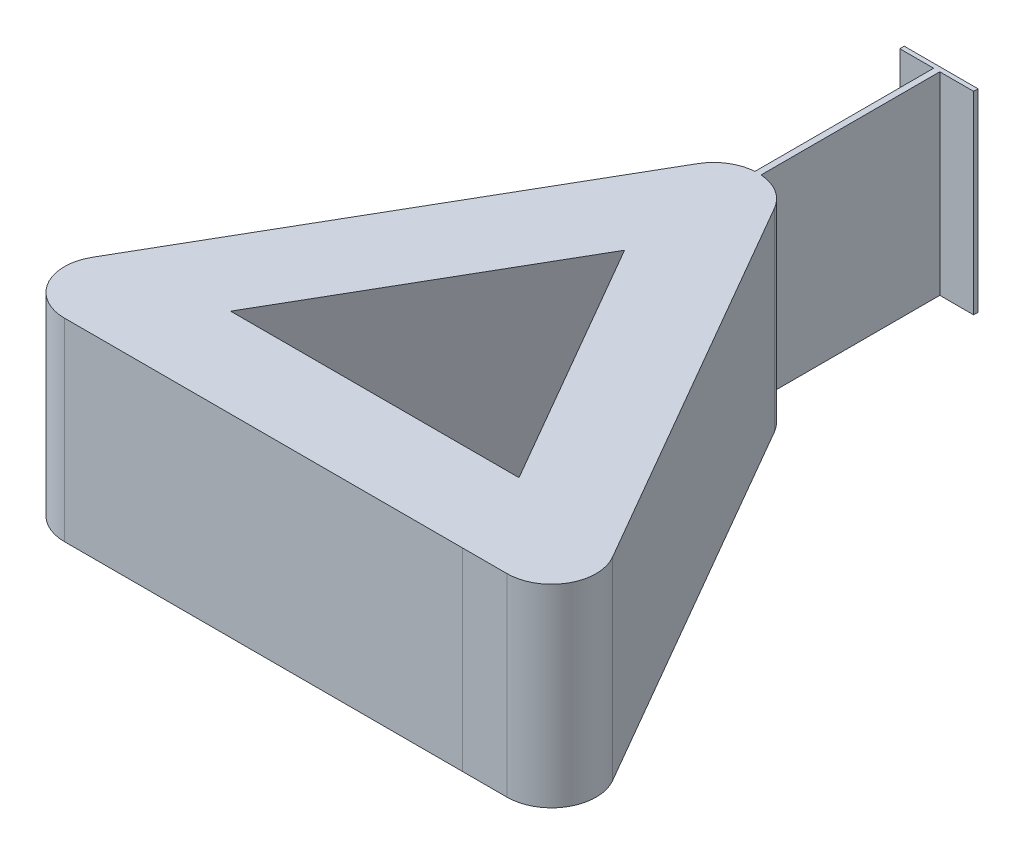
ISO-10303-21;
HEADER;
FILE_DESCRIPTION(('STEP AP214'),'2;1');
FILE_NAME('part.step','',(''),(''),'','','');
FILE_SCHEMA(('AUTOMOTIVE_DESIGN { 1 0 10303 214 1 1 1 1 }'));
ENDSEC;
DATA;
#1=APPLICATION_CONTEXT('core data for automotive mechanical design processes');
#2=APPLICATION_PROTOCOL_DEFINITION('international standard','automotive_design',2000,#1);
#3=PRODUCT_CONTEXT('',#1,'mechanical');
#4=PRODUCT('Part','Part','',(#3));
#5=PRODUCT_RELATED_PRODUCT_CATEGORY('part','',(#4));
#6=PRODUCT_DEFINITION_FORMATION('','',#4);
#7=PRODUCT_DEFINITION_CONTEXT('part definition',#1,'design');
#8=PRODUCT_DEFINITION('design','',#6,#7);
#9=PRODUCT_DEFINITION_SHAPE('','',#8);
#10=(LENGTH_UNIT() NAMED_UNIT(*) SI_UNIT(.MILLI.,.METRE.));
#11=(NAMED_UNIT(*) PLANE_ANGLE_UNIT() SI_UNIT($,.RADIAN.));
#12=(NAMED_UNIT(*) SI_UNIT($,.STERADIAN.) SOLID_ANGLE_UNIT());
#13=UNCERTAINTY_MEASURE_WITH_UNIT(LENGTH_MEASURE(1.E-05),#10,'distance_accuracy_value','');
#14=(GEOMETRIC_REPRESENTATION_CONTEXT(3) GLOBAL_UNCERTAINTY_ASSIGNED_CONTEXT((#13)) GLOBAL_UNIT_ASSIGNED_CONTEXT((#10,
#11,#12)) REPRESENTATION_CONTEXT('',''));
#15=CARTESIAN_POINT('',(0.,0.,0.));
#16=DIRECTION('',(0.,0.,1.));
#17=DIRECTION('',(1.,0.,0.));
#18=AXIS2_PLACEMENT_3D('',#15,#16,#17);
#19=CARTESIAN_POINT('',(-1.1892693357852E-05,100.,42.9911041493912));
#20=DIRECTION('',(2.76631493727754E-07,0.,-0.999999999999962));
#21=DIRECTION('',(-0.999999999999962,0.,-2.76631493727754E-07));
#22=AXIS2_PLACEMENT_3D('',#19,#20,#21);
#23=PLANE('',#22);
#24=DIRECTION('',(0.999999999999962,0.,2.76631493727754E-07));
#25=VECTOR('',#24,1.);
#26=CARTESIAN_POINT('',(-1.1892693357852E-05,0.,42.9911041493912));
#27=LINE('',#26,#25);
#28=CARTESIAN_POINT('',(-74.4627409821725,0.,42.9910835506552));
#29=VERTEX_POINT('',#28);
#30=CARTESIAN_POINT('',(74.4628250633905,0.,42.991124748157));
#31=VERTEX_POINT('',#30);
#32=EDGE_CURVE('E186',#29,#31,#27,.T.);
#33=ORIENTED_EDGE('',*,*,#32,.F.);
#34=DIRECTION('',(0.,-1.,0.));
#35=VECTOR('',#34,1.);
#36=CARTESIAN_POINT('',(-74.4627409821725,100.,42.9910835506552));
#37=LINE('',#36,#35);
#38=CARTESIAN_POINT('',(-74.4627409821725,100.,42.9910835506552));
#39=VERTEX_POINT('',#38);
#40=EDGE_CURVE('E11',#39,#29,#37,.T.);
#41=ORIENTED_EDGE('',*,*,#40,.F.);
#42=DIRECTION('',(0.999999999999962,0.,2.76631493727754E-07));
#43=VECTOR('',#42,1.);
#44=CARTESIAN_POINT('',(-1.1892693357852E-05,100.,42.9911041493912));
#45=LINE('',#44,#43);
#46=CARTESIAN_POINT('',(74.4628250633905,100.,42.991124748157));
#47=VERTEX_POINT('',#46);
#48=EDGE_CURVE('E184',#39,#47,#45,.T.);
#49=ORIENTED_EDGE('',*,*,#48,.T.);
#50=DIRECTION('',(0.,-1.,0.));
#51=VECTOR('',#50,1.);
#52=CARTESIAN_POINT('',(74.4628250633905,100.,42.991124748157));
#53=LINE('',#52,#51);
#54=EDGE_CURVE('E67',#47,#31,#53,.T.);
#55=ORIENTED_EDGE('',*,*,#54,.T.);
#56=EDGE_LOOP('',(#33,#41,#49,#55));
#57=FACE_BOUND('',#56,.T.);
#58=ADVANCED_FACE('F47',(#57),#23,.T.);
#59=CARTESIAN_POINT('',(-37.2313942764617,100.,-21.4955417753206));
#60=DIRECTION('',(0.866025542100154,0.,0.499999760430077));
#61=DIRECTION('',(0.499999760430077,0.,-0.866025542100154));
#62=AXIS2_PLACEMENT_3D('',#59,#60,#61);
#63=PLANE('',#62);
#64=DIRECTION('',(-0.499999760430077,0.,0.866025542100154));
#65=VECTOR('',#64,1.);
#66=CARTESIAN_POINT('',(-37.2313942764617,0.,-21.4955417753206));
#67=LINE('',#66,#65);
#68=CARTESIAN_POINT('',(6.36252549951477E-06,0.,-85.982260516531));
#69=VERTEX_POINT('',#68);
#70=EDGE_CURVE('E264',#69,#29,#67,.T.);
#71=ORIENTED_EDGE('',*,*,#70,.F.);
#72=DIRECTION('',(0.,-1.,0.));
#73=VECTOR('',#72,1.);
#74=CARTESIAN_POINT('',(6.36252549951477E-06,100.,-85.982260516531));
#75=LINE('',#74,#73);
#76=CARTESIAN_POINT('',(6.36252549951477E-06,100.,-85.982260516531));
#77=VERTEX_POINT('',#76);
#78=EDGE_CURVE('E58',#77,#69,#75,.T.);
#79=ORIENTED_EDGE('',*,*,#78,.F.);
#80=DIRECTION('',(-0.499999760430077,0.,0.866025542100154));
#81=VECTOR('',#80,1.);
#82=CARTESIAN_POINT('',(-37.2313942764617,100.,-21.4955417753206));
#83=LINE('',#82,#81);
#84=EDGE_CURVE('E193',#77,#39,#83,.T.);
#85=ORIENTED_EDGE('',*,*,#84,.T.);
#86=ORIENTED_EDGE('',*,*,#40,.T.);
#87=EDGE_LOOP('',(#71,#79,#85,#86));
#88=FACE_BOUND('',#87,.T.);
#89=ADVANCED_FACE('F198',(#88),#63,.T.);
#90=CARTESIAN_POINT('',(-77.0686390527215,100.,-44.4955995031668));
#91=DIRECTION('',(0.866025403784439,0.,0.5));
#92=DIRECTION('',(0.5,0.,-0.866025403784439));
#93=AXIS2_PLACEMENT_3D('',#90,#91,#92);
#94=PLANE('',#93);
#95=DIRECTION('',(-0.5,0.,0.866025403784439));
#96=VECTOR('',#95,1.);
#97=CARTESIAN_POINT('',(-77.0686390527215,0.,-44.4955995031668));
#98=LINE('',#97,#96);
#99=CARTESIAN_POINT('',(-31.4186390527215,0.,-123.563718868686));
#100=VERTEX_POINT('',#99);
#101=CARTESIAN_POINT('',(-134.218639052721,0.,54.4911041493944));
#102=VERTEX_POINT('',#101);
#103=EDGE_CURVE('E206',#100,#102,#98,.T.);
#104=ORIENTED_EDGE('',*,*,#103,.T.);
#105=DIRECTION('',(0.,-1.,0.));
#106=VECTOR('',#105,1.);
#107=CARTESIAN_POINT('',(-134.218639052721,100.,54.4911041493944));
#108=LINE('',#107,#106);
#109=CARTESIAN_POINT('',(-134.218639052721,100.,54.4911041493944));
#110=VERTEX_POINT('',#109);
#111=EDGE_CURVE('E51',#110,#102,#108,.T.);
#112=ORIENTED_EDGE('',*,*,#111,.F.);
#113=DIRECTION('',(-0.5,0.,0.866025403784439));
#114=VECTOR('',#113,1.);
#115=CARTESIAN_POINT('',(-77.0686390527215,100.,-44.4955995031668));
#116=LINE('',#115,#114);
#117=CARTESIAN_POINT('',(-31.4186390527215,100.,-123.563718868686));
#118=VERTEX_POINT('',#117);
#119=EDGE_CURVE('E271',#118,#110,#116,.T.);
#120=ORIENTED_EDGE('',*,*,#119,.F.);
#121=DIRECTION('',(0.,-1.,0.));
#122=VECTOR('',#121,1.);
#123=CARTESIAN_POINT('',(-31.4186390527215,100.,-123.563718868686));
#124=LINE('',#123,#122);
#125=EDGE_CURVE('E202',#118,#100,#124,.T.);
#126=ORIENTED_EDGE('',*,*,#125,.T.);
#127=EDGE_LOOP('',(#104,#112,#120,#126));
#128=FACE_BOUND('',#127,.T.);
#129=ADVANCED_FACE('F49',(#128),#94,.F.);
#130=CARTESIAN_POINT('',(-114.3,100.,65.9911357683742));
#131=DIRECTION('',(0.,-1.,0.));
#132=DIRECTION('',(0.,0.,-1.));
#133=AXIS2_PLACEMENT_3D('',#130,#131,#132);
#134=CYLINDRICAL_SURFACE('',#133,23.0000632379595);
#135=CARTESIAN_POINT('',(-114.3,0.,65.9911357683742));
#136=DIRECTION('',(0.,1.,0.));
#137=DIRECTION('',(0.,0.,1.));
#138=AXIS2_PLACEMENT_3D('',#135,#136,#137);
#139=CIRCLE('',#138,23.0000632379595);
#140=CARTESIAN_POINT('',(-114.3,0.,88.9911990063337));
#141=VERTEX_POINT('',#140);
#142=EDGE_CURVE('E210',#102,#141,#139,.T.);
#143=ORIENTED_EDGE('',*,*,#142,.T.);
#144=DIRECTION('',(0.,-1.,0.));
#145=VECTOR('',#144,1.);
#146=CARTESIAN_POINT('',(-114.3,100.,88.9911990063337));
#147=LINE('',#146,#145);
#148=CARTESIAN_POINT('',(-114.3,100.,88.9911990063337));
#149=VERTEX_POINT('',#148);
#150=EDGE_CURVE('E320',#149,#141,#147,.T.);
#151=ORIENTED_EDGE('',*,*,#150,.F.);
#152=CARTESIAN_POINT('',(-114.3,100.,65.9911357683742));
#153=DIRECTION('',(0.,1.,0.));
#154=DIRECTION('',(0.,0.,1.));
#155=AXIS2_PLACEMENT_3D('',#152,#153,#154);
#156=CIRCLE('',#155,23.0000632379595);
#157=EDGE_CURVE('E137',#110,#149,#156,.T.);
#158=ORIENTED_EDGE('',*,*,#157,.F.);
#159=ORIENTED_EDGE('',*,*,#111,.T.);
#160=EDGE_LOOP('',(#143,#151,#158,#159));
#161=FACE_BOUND('',#160,.T.);
#162=ADVANCED_FACE('F328',(#161),#134,.T.);
#163=CARTESIAN_POINT('',(2.46177596169639E-05,100.,88.9911673873471));
#164=DIRECTION('',(-2.76631494334831E-07,0.,-0.999999999999962));
#165=DIRECTION('',(-0.999999999999962,0.,2.76631494334831E-07));
#166=AXIS2_PLACEMENT_3D('',#163,#164,#165);
#167=PLANE('',#166);
#168=DIRECTION('',(0.999999999999962,0.,-2.76631494334831E-07));
#169=VECTOR('',#168,1.);
#170=CARTESIAN_POINT('',(2.46177596169639E-05,0.,88.9911673873471));
#171=LINE('',#170,#169);
#172=CARTESIAN_POINT('',(91.2999999999999,0.,88.9911357683742));
#173=VERTEX_POINT('',#172);
#174=EDGE_CURVE('E213',#141,#173,#171,.T.);
#175=ORIENTED_EDGE('',*,*,#174,.T.);
#176=DIRECTION('',(0.,-1.,0.));
#177=VECTOR('',#176,1.);
#178=CARTESIAN_POINT('',(91.2999999999999,100.,88.9911357683742));
#179=LINE('',#178,#177);
#180=CARTESIAN_POINT('',(91.2999999999999,100.,88.9911357683742));
#181=VERTEX_POINT('',#180);
#182=EDGE_CURVE('E317',#181,#173,#179,.T.);
#183=ORIENTED_EDGE('',*,*,#182,.F.);
#184=DIRECTION('',(0.999999999999962,0.,-2.76631494334831E-07));
#185=VECTOR('',#184,1.);
#186=CARTESIAN_POINT('',(2.46177596169639E-05,100.,88.9911673873471));
#187=LINE('',#186,#185);
#188=EDGE_CURVE('E352',#149,#181,#187,.T.);
#189=ORIENTED_EDGE('',*,*,#188,.F.);
#190=ORIENTED_EDGE('',*,*,#150,.T.);
#191=EDGE_LOOP('',(#175,#183,#189,#190));
#192=FACE_BOUND('',#191,.T.);
#193=ADVANCED_FACE('F446',(#192),#167,.F.);
#194=CARTESIAN_POINT('',(3.75869595338669E-13,100.,88.9911357683746));
#195=DIRECTION('',(0.,0.,-1.));
#196=DIRECTION('',(-1.,0.,0.));
#197=AXIS2_PLACEMENT_3D('',#194,#195,#196);
#198=PLANE('',#197);
#199=DIRECTION('',(1.,0.,0.));
#200=VECTOR('',#199,1.);
#201=CARTESIAN_POINT('',(3.75869595338669E-13,0.,88.9911357683746));
#202=LINE('',#201,#200);
#203=CARTESIAN_POINT('',(114.3,0.,88.9911357683741));
#204=VERTEX_POINT('',#203);
#205=EDGE_CURVE('E216',#173,#204,#202,.T.);
#206=ORIENTED_EDGE('',*,*,#205,.T.);
#207=DIRECTION('',(0.,-1.,0.));
#208=VECTOR('',#207,1.);
#209=CARTESIAN_POINT('',(114.3,100.,88.9911357683741));
#210=LINE('',#209,#208);
#211=CARTESIAN_POINT('',(114.3,100.,88.9911357683741));
#212=VERTEX_POINT('',#211);
#213=EDGE_CURVE('E313',#212,#204,#210,.T.);
#214=ORIENTED_EDGE('',*,*,#213,.F.);
#215=DIRECTION('',(1.,0.,0.));
#216=VECTOR('',#215,1.);
#217=CARTESIAN_POINT('',(3.75869595338669E-13,100.,88.9911357683746));
#218=LINE('',#217,#216);
#219=EDGE_CURVE('E355',#181,#212,#218,.T.);
#220=ORIENTED_EDGE('',*,*,#219,.F.);
#221=ORIENTED_EDGE('',*,*,#182,.T.);
#222=EDGE_LOOP('',(#206,#214,#220,#221));
#223=FACE_BOUND('',#222,.T.);
#224=ADVANCED_FACE('F443',(#223),#198,.F.);
#225=CARTESIAN_POINT('',(114.3,100.,65.9911357683742));
#226=DIRECTION('',(0.,-1.,0.));
#227=DIRECTION('',(0.,0.,-1.));
#228=AXIS2_PLACEMENT_3D('',#225,#226,#227);
#229=CYLINDRICAL_SURFACE('',#228,23.);
#230=CARTESIAN_POINT('',(114.3,0.,65.9911357683742));
#231=DIRECTION('',(0.,1.,0.));
#232=DIRECTION('',(0.,0.,1.));
#233=AXIS2_PLACEMENT_3D('',#230,#231,#232);
#234=CIRCLE('',#233,23.);
#235=CARTESIAN_POINT('',(134.218584287042,0.,54.4911357683743));
#236=VERTEX_POINT('',#235);
#237=EDGE_CURVE('E219',#204,#236,#234,.T.);
#238=ORIENTED_EDGE('',*,*,#237,.T.);
#239=DIRECTION('',(0.,-1.,0.));
#240=VECTOR('',#239,1.);
#241=CARTESIAN_POINT('',(134.218584287042,100.,54.4911357683743));
#242=LINE('',#241,#240);
#243=CARTESIAN_POINT('',(134.218584287042,100.,54.4911357683743));
#244=VERTEX_POINT('',#243);
#245=EDGE_CURVE('E310',#244,#236,#242,.T.);
#246=ORIENTED_EDGE('',*,*,#245,.F.);
#247=CARTESIAN_POINT('',(114.3,100.,65.9911357683742));
#248=DIRECTION('',(0.,1.,0.));
#249=DIRECTION('',(0.,0.,1.));
#250=AXIS2_PLACEMENT_3D('',#247,#248,#249);
#251=CIRCLE('',#250,23.);
#252=EDGE_CURVE('E358',#212,#244,#251,.T.);
#253=ORIENTED_EDGE('',*,*,#252,.F.);
#254=ORIENTED_EDGE('',*,*,#213,.T.);
#255=EDGE_LOOP('',(#238,#246,#253,#254));
#256=FACE_BOUND('',#255,.T.);
#257=ADVANCED_FACE('F439',(#256),#229,.T.);
#258=CARTESIAN_POINT('',(77.0685842870421,100.,-44.4955678841872));
#259=DIRECTION('',(0.866025403784438,0.,-0.5));
#260=DIRECTION('',(-0.5,0.,-0.866025403784438));
#261=AXIS2_PLACEMENT_3D('',#258,#259,#260);
#262=PLANE('',#261);
#263=DIRECTION('',(0.5,0.,0.866025403784438));
#264=VECTOR('',#263,1.);
#265=CARTESIAN_POINT('',(77.0685842870421,0.,-44.4955678841872));
#266=LINE('',#265,#264);
#267=CARTESIAN_POINT('',(19.9185842870421,0.,-143.482271536748));
#268=VERTEX_POINT('',#267);
#269=EDGE_CURVE('E223',#268,#236,#266,.T.);
#270=ORIENTED_EDGE('',*,*,#269,.F.);
#271=DIRECTION('',(0.,-1.,0.));
#272=VECTOR('',#271,1.);
#273=CARTESIAN_POINT('',(19.9185842870421,100.,-143.482271536748));
#274=LINE('',#273,#272);
#275=CARTESIAN_POINT('',(19.9185842870421,100.,-143.482271536748));
#276=VERTEX_POINT('',#275);
#277=EDGE_CURVE('E307',#276,#268,#274,.T.);
#278=ORIENTED_EDGE('',*,*,#277,.F.);
#279=DIRECTION('',(0.5,0.,0.866025403784438));
#280=VECTOR('',#279,1.);
#281=CARTESIAN_POINT('',(77.0685842870421,100.,-44.4955678841872));
#282=LINE('',#281,#280);
#283=EDGE_CURVE('E361',#276,#244,#282,.T.);
#284=ORIENTED_EDGE('',*,*,#283,.T.);
#285=ORIENTED_EDGE('',*,*,#245,.T.);
#286=EDGE_LOOP('',(#270,#278,#284,#285));
#287=FACE_BOUND('',#286,.T.);
#288=ADVANCED_FACE('F433',(#287),#262,.T.);
#289=CARTESIAN_POINT('',(0.,100.,-131.982271536748));
#290=DIRECTION('',(0.,-1.,0.));
#291=DIRECTION('',(0.,0.,-1.));
#292=AXIS2_PLACEMENT_3D('',#289,#290,#291);
#293=CYLINDRICAL_SURFACE('',#292,23.);
#294=CARTESIAN_POINT('',(0.,0.,-131.982271536748));
#295=DIRECTION('',(0.,1.,0.));
#296=DIRECTION('',(0.,0.,1.));
#297=AXIS2_PLACEMENT_3D('',#294,#295,#296);
#298=CIRCLE('',#297,23.);
#299=CARTESIAN_POINT('',(1.58749999999999,0.,-154.927420125285));
#300=VERTEX_POINT('',#299);
#301=EDGE_CURVE('E227',#268,#300,#298,.T.);
#302=ORIENTED_EDGE('',*,*,#301,.T.);
#303=DIRECTION('',(0.,-1.,0.));
#304=VECTOR('',#303,1.);
#305=CARTESIAN_POINT('',(1.58749999999999,100.,-154.927420125285));
#306=LINE('',#305,#304);
#307=CARTESIAN_POINT('',(1.58749999999999,100.,-154.927420125285));
#308=VERTEX_POINT('',#307);
#309=EDGE_CURVE('E303',#308,#300,#306,.T.);
#310=ORIENTED_EDGE('',*,*,#309,.F.);
#311=CARTESIAN_POINT('',(0.,100.,-131.982271536748));
#312=DIRECTION('',(0.,1.,0.));
#313=DIRECTION('',(0.,0.,1.));
#314=AXIS2_PLACEMENT_3D('',#311,#312,#313);
#315=CIRCLE('',#314,23.);
#316=EDGE_CURVE('E365',#276,#308,#315,.T.);
#317=ORIENTED_EDGE('',*,*,#316,.F.);
#318=ORIENTED_EDGE('',*,*,#277,.T.);
#319=EDGE_LOOP('',(#302,#310,#317,#318));
#320=FACE_BOUND('',#319,.T.);
#321=ADVANCED_FACE('F447',(#320),#293,.T.);
#322=CARTESIAN_POINT('',(1.58749999999997,100.,0.));
#323=DIRECTION('',(-1.,0.,0.));
#324=DIRECTION('',(0.,0.,1.));
#325=AXIS2_PLACEMENT_3D('',#322,#323,#324);
#326=PLANE('',#325);
#327=DIRECTION('',(0.,0.,-1.));
#328=VECTOR('',#327,1.);
#329=CARTESIAN_POINT('',(1.58749999999997,0.,0.));
#330=LINE('',#329,#328);
#331=CARTESIAN_POINT('',(1.5875,0.,-247.184248335981));
#332=VERTEX_POINT('',#331);
#333=EDGE_CURVE('E230',#300,#332,#330,.T.);
#334=ORIENTED_EDGE('',*,*,#333,.T.);
#335=DIRECTION('',(0.,-1.,0.));
#336=VECTOR('',#335,1.);
#337=CARTESIAN_POINT('',(1.5875,100.,-247.184248335981));
#338=LINE('',#337,#336);
#339=CARTESIAN_POINT('',(1.5875,100.,-247.184248335981));
#340=VERTEX_POINT('',#339);
#341=EDGE_CURVE('E299',#340,#332,#338,.T.);
#342=ORIENTED_EDGE('',*,*,#341,.F.);
#343=DIRECTION('',(0.,0.,-1.));
#344=VECTOR('',#343,1.);
#345=CARTESIAN_POINT('',(1.58749999999997,100.,0.));
#346=LINE('',#345,#344);
#347=EDGE_CURVE('E368',#308,#340,#346,.T.);
#348=ORIENTED_EDGE('',*,*,#347,.F.);
#349=ORIENTED_EDGE('',*,*,#309,.T.);
#350=EDGE_LOOP('',(#334,#342,#348,#349));
#351=FACE_BOUND('',#350,.T.);
#352=ADVANCED_FACE('F426',(#351),#326,.F.);
#353=CARTESIAN_POINT('',(0.,100.,-247.184248335981));
#354=DIRECTION('',(0.,0.,-1.));
#355=DIRECTION('',(-1.,0.,0.));
#356=AXIS2_PLACEMENT_3D('',#353,#354,#355);
#357=PLANE('',#356);
#358=DIRECTION('',(1.,0.,0.));
#359=VECTOR('',#358,1.);
#360=CARTESIAN_POINT('',(0.,0.,-247.184248335981));
#361=LINE('',#360,#359);
#362=CARTESIAN_POINT('',(19.05,0.,-247.184248335981));
#363=VERTEX_POINT('',#362);
#364=EDGE_CURVE('E234',#332,#363,#361,.T.);
#365=ORIENTED_EDGE('',*,*,#364,.T.);
#366=DIRECTION('',(0.,-1.,0.));
#367=VECTOR('',#366,1.);
#368=CARTESIAN_POINT('',(19.05,100.,-247.184248335981));
#369=LINE('',#368,#367);
#370=CARTESIAN_POINT('',(19.05,100.,-247.184248335981));
#371=VERTEX_POINT('',#370);
#372=EDGE_CURVE('E296',#371,#363,#369,.T.);
#373=ORIENTED_EDGE('',*,*,#372,.F.);
#374=DIRECTION('',(1.,0.,0.));
#375=VECTOR('',#374,1.);
#376=CARTESIAN_POINT('',(0.,100.,-247.184248335981));
#377=LINE('',#376,#375);
#378=EDGE_CURVE('E372',#340,#371,#377,.T.);
#379=ORIENTED_EDGE('',*,*,#378,.F.);
#380=ORIENTED_EDGE('',*,*,#341,.T.);
#381=EDGE_LOOP('',(#365,#373,#379,#380));
#382=FACE_BOUND('',#381,.T.);
#383=ADVANCED_FACE('F422',(#382),#357,.F.);
#384=CARTESIAN_POINT('',(19.05,100.,0.));
#385=DIRECTION('',(1.,0.,0.));
#386=DIRECTION('',(0.,0.,-1.));
#387=AXIS2_PLACEMENT_3D('',#384,#385,#386);
#388=PLANE('',#387);
#389=DIRECTION('',(0.,0.,1.));
#390=VECTOR('',#389,1.);
#391=CARTESIAN_POINT('',(19.05,0.,0.));
#392=LINE('',#391,#390);
#393=CARTESIAN_POINT('',(19.05,0.,-249.457271536748));
#394=VERTEX_POINT('',#393);
#395=EDGE_CURVE('E238',#394,#363,#392,.T.);
#396=ORIENTED_EDGE('',*,*,#395,.F.);
#397=DIRECTION('',(0.,-1.,0.));
#398=VECTOR('',#397,1.);
#399=CARTESIAN_POINT('',(19.05,100.,-249.457271536748));
#400=LINE('',#399,#398);
#401=CARTESIAN_POINT('',(19.05,100.,-249.457271536748));
#402=VERTEX_POINT('',#401);
#403=EDGE_CURVE('E293',#402,#394,#400,.T.);
#404=ORIENTED_EDGE('',*,*,#403,.F.);
#405=DIRECTION('',(0.,0.,1.));
#406=VECTOR('',#405,1.);
#407=CARTESIAN_POINT('',(19.05,100.,0.));
#408=LINE('',#407,#406);
#409=EDGE_CURVE('E375',#402,#371,#408,.T.);
#410=ORIENTED_EDGE('',*,*,#409,.T.);
#411=ORIENTED_EDGE('',*,*,#372,.T.);
#412=EDGE_LOOP('',(#396,#404,#410,#411));
#413=FACE_BOUND('',#412,.T.);
#414=ADVANCED_FACE('F417',(#413),#388,.T.);
#415=CARTESIAN_POINT('',(0.,100.,-249.457271536748));
#416=DIRECTION('',(0.,0.,-1.));
#417=DIRECTION('',(-1.,0.,0.));
#418=AXIS2_PLACEMENT_3D('',#415,#416,#417);
#419=PLANE('',#418);
#420=DIRECTION('',(1.,0.,0.));
#421=VECTOR('',#420,1.);
#422=CARTESIAN_POINT('',(0.,0.,-249.457271536748));
#423=LINE('',#422,#421);
#424=CARTESIAN_POINT('',(-19.05,0.,-249.457271536748));
#425=VERTEX_POINT('',#424);
#426=EDGE_CURVE('E242',#425,#394,#423,.T.);
#427=ORIENTED_EDGE('',*,*,#426,.F.);
#428=DIRECTION('',(0.,-1.,0.));
#429=VECTOR('',#428,1.);
#430=CARTESIAN_POINT('',(-19.05,100.,-249.457271536748));
#431=LINE('',#430,#429);
#432=CARTESIAN_POINT('',(-19.05,100.,-249.457271536748));
#433=VERTEX_POINT('',#432);
#434=EDGE_CURVE('E290',#433,#425,#431,.T.);
#435=ORIENTED_EDGE('',*,*,#434,.F.);
#436=DIRECTION('',(1.,0.,0.));
#437=VECTOR('',#436,1.);
#438=CARTESIAN_POINT('',(0.,100.,-249.457271536748));
#439=LINE('',#438,#437);
#440=EDGE_CURVE('E379',#433,#402,#439,.T.);
#441=ORIENTED_EDGE('',*,*,#440,.T.);
#442=ORIENTED_EDGE('',*,*,#403,.T.);
#443=EDGE_LOOP('',(#427,#435,#441,#442));
#444=FACE_BOUND('',#443,.T.);
#445=ADVANCED_FACE('F412',(#444),#419,.T.);
#446=CARTESIAN_POINT('',(-19.05,100.,0.));
#447=DIRECTION('',(1.,0.,0.));
#448=DIRECTION('',(0.,0.,-1.));
#449=AXIS2_PLACEMENT_3D('',#446,#447,#448);
#450=PLANE('',#449);
#451=DIRECTION('',(0.,0.,1.));
#452=VECTOR('',#451,1.);
#453=CARTESIAN_POINT('',(-19.05,0.,0.));
#454=LINE('',#453,#452);
#455=CARTESIAN_POINT('',(-19.05,0.,-247.184248335981));
#456=VERTEX_POINT('',#455);
#457=EDGE_CURVE('E246',#425,#456,#454,.T.);
#458=ORIENTED_EDGE('',*,*,#457,.T.);
#459=DIRECTION('',(0.,-1.,0.));
#460=VECTOR('',#459,1.);
#461=CARTESIAN_POINT('',(-19.05,100.,-247.184248335981));
#462=LINE('',#461,#460);
#463=CARTESIAN_POINT('',(-19.05,100.,-247.184248335981));
#464=VERTEX_POINT('',#463);
#465=EDGE_CURVE('E287',#464,#456,#462,.T.);
#466=ORIENTED_EDGE('',*,*,#465,.F.);
#467=DIRECTION('',(0.,0.,1.));
#468=VECTOR('',#467,1.);
#469=CARTESIAN_POINT('',(-19.05,100.,0.));
#470=LINE('',#469,#468);
#471=EDGE_CURVE('E383',#433,#464,#470,.T.);
#472=ORIENTED_EDGE('',*,*,#471,.F.);
#473=ORIENTED_EDGE('',*,*,#434,.T.);
#474=EDGE_LOOP('',(#458,#466,#472,#473));
#475=FACE_BOUND('',#474,.T.);
#476=ADVANCED_FACE('F409',(#475),#450,.F.);
#477=CARTESIAN_POINT('',(0.,100.,-247.184248335981));
#478=DIRECTION('',(0.,0.,1.));
#479=DIRECTION('',(1.,0.,0.));
#480=AXIS2_PLACEMENT_3D('',#477,#478,#479);
#481=PLANE('',#480);
#482=DIRECTION('',(-1.,0.,0.));
#483=VECTOR('',#482,1.);
#484=CARTESIAN_POINT('',(0.,0.,-247.184248335981));
#485=LINE('',#484,#483);
#486=CARTESIAN_POINT('',(-1.58750000000002,0.,-247.184248335981));
#487=VERTEX_POINT('',#486);
#488=EDGE_CURVE('E250',#487,#456,#485,.T.);
#489=ORIENTED_EDGE('',*,*,#488,.F.);
#490=DIRECTION('',(0.,-1.,0.));
#491=VECTOR('',#490,1.);
#492=CARTESIAN_POINT('',(-1.58750000000002,100.,-247.184248335981));
#493=LINE('',#492,#491);
#494=CARTESIAN_POINT('',(-1.58750000000002,100.,-247.184248335981));
#495=VERTEX_POINT('',#494);
#496=EDGE_CURVE('E284',#495,#487,#493,.T.);
#497=ORIENTED_EDGE('',*,*,#496,.F.);
#498=DIRECTION('',(-1.,0.,0.));
#499=VECTOR('',#498,1.);
#500=CARTESIAN_POINT('',(0.,100.,-247.184248335981));
#501=LINE('',#500,#499);
#502=EDGE_CURVE('E386',#495,#464,#501,.T.);
#503=ORIENTED_EDGE('',*,*,#502,.T.);
#504=ORIENTED_EDGE('',*,*,#465,.T.);
#505=EDGE_LOOP('',(#489,#497,#503,#504));
#506=FACE_BOUND('',#505,.T.);
#507=ADVANCED_FACE('F405',(#506),#481,.T.);
#508=CARTESIAN_POINT('',(-1.58750000000002,100.,0.));
#509=DIRECTION('',(-1.,0.,0.));
#510=DIRECTION('',(0.,0.,1.));
#511=AXIS2_PLACEMENT_3D('',#508,#509,#510);
#512=PLANE('',#511);
#513=DIRECTION('',(0.,0.,-1.));
#514=VECTOR('',#513,1.);
#515=CARTESIAN_POINT('',(-1.58750000000002,0.,0.));
#516=LINE('',#515,#514);
#517=CARTESIAN_POINT('',(-1.58750000000002,0.,-154.927420125285));
#518=VERTEX_POINT('',#517);
#519=EDGE_CURVE('E254',#518,#487,#516,.T.);
#520=ORIENTED_EDGE('',*,*,#519,.F.);
#521=DIRECTION('',(0.,-1.,0.));
#522=VECTOR('',#521,1.);
#523=CARTESIAN_POINT('',(-1.58750000000002,100.,-154.927420125285));
#524=LINE('',#523,#522);
#525=CARTESIAN_POINT('',(-1.58750000000002,100.,-154.927420125285));
#526=VERTEX_POINT('',#525);
#527=EDGE_CURVE('E281',#526,#518,#524,.T.);
#528=ORIENTED_EDGE('',*,*,#527,.F.);
#529=DIRECTION('',(0.,0.,-1.));
#530=VECTOR('',#529,1.);
#531=CARTESIAN_POINT('',(-1.58750000000002,100.,0.));
#532=LINE('',#531,#530);
#533=EDGE_CURVE('E390',#526,#495,#532,.T.);
#534=ORIENTED_EDGE('',*,*,#533,.T.);
#535=ORIENTED_EDGE('',*,*,#496,.T.);
#536=EDGE_LOOP('',(#520,#528,#534,#535));
#537=FACE_BOUND('',#536,.T.);
#538=ADVANCED_FACE('F400',(#537),#512,.T.);
#539=CARTESIAN_POINT('',(-19.9185526680306,0.,-143.482326302309));
#540=VERTEX_POINT('',#539);
#541=EDGE_CURVE('E231',#518,#540,#298,.T.);
#542=ORIENTED_EDGE('',*,*,#541,.T.);
#543=DIRECTION('',(0.,-1.,0.));
#544=VECTOR('',#543,1.);
#545=CARTESIAN_POINT('',(-19.9185526680306,100.,-143.482326302309));
#546=LINE('',#545,#544);
#547=CARTESIAN_POINT('',(-19.9185526680306,100.,-143.482326302309));
#548=VERTEX_POINT('',#547);
#549=EDGE_CURVE('E278',#548,#540,#546,.T.);
#550=ORIENTED_EDGE('',*,*,#549,.F.);
#551=EDGE_CURVE('E370',#526,#548,#315,.T.);
#552=ORIENTED_EDGE('',*,*,#551,.F.);
#553=ORIENTED_EDGE('',*,*,#527,.T.);
#554=EDGE_LOOP('',(#542,#550,#552,#553));
#555=FACE_BOUND('',#554,.T.);
#556=ADVANCED_FACE('F345',(#555),#293,.T.);
#557=CARTESIAN_POINT('',(-77.068734107994,100.,-44.4959369149786));
#558=DIRECTION('',(-0.866024029044805,0.,-0.500002381111333));
#559=DIRECTION('',(-0.500002381111333,0.,0.866024029044805));
#560=AXIS2_PLACEMENT_3D('',#557,#558,#559);
#561=PLANE('',#560);
#562=DIRECTION('',(0.500002381111333,0.,-0.866024029044805));
#563=VECTOR('',#562,1.);
#564=CARTESIAN_POINT('',(-77.068734107994,0.,-44.4959369149786));
#565=LINE('',#564,#563);
#566=EDGE_CURVE('E258',#100,#540,#565,.T.);
#567=ORIENTED_EDGE('',*,*,#566,.F.);
#568=ORIENTED_EDGE('',*,*,#125,.F.);
#569=DIRECTION('',(0.500002381111333,0.,-0.866024029044805));
#570=VECTOR('',#569,1.);
#571=CARTESIAN_POINT('',(-77.068734107994,100.,-44.4959369149786));
#572=LINE('',#571,#570);
#573=EDGE_CURVE('E196',#118,#548,#572,.T.);
#574=ORIENTED_EDGE('',*,*,#573,.T.);
#575=ORIENTED_EDGE('',*,*,#549,.T.);
#576=EDGE_LOOP('',(#567,#568,#574,#575));
#577=FACE_BOUND('',#576,.T.);
#578=ADVANCED_FACE('F338',(#577),#561,.T.);
#579=CARTESIAN_POINT('',(37.2314157129579,100.,-21.4955678841871));
#580=DIRECTION('',(-0.866025403784438,0.,0.5));
#581=DIRECTION('',(0.5,0.,0.866025403784438));
#582=AXIS2_PLACEMENT_3D('',#579,#580,#581);
#583=PLANE('',#582);
#584=DIRECTION('',(-0.500000000000001,0.,-0.866025403784438));
#585=VECTOR('',#584,1.);
#586=CARTESIAN_POINT('',(37.2314157129579,0.,-21.4955678841871));
#587=LINE('',#586,#585);
#588=EDGE_CURVE('E267',#31,#69,#587,.T.);
#589=ORIENTED_EDGE('',*,*,#588,.F.);
#590=ORIENTED_EDGE('',*,*,#54,.F.);
#591=DIRECTION('',(-0.500000000000001,0.,-0.866025403784438));
#592=VECTOR('',#591,1.);
#593=CARTESIAN_POINT('',(37.2314157129579,100.,-21.4955678841871));
#594=LINE('',#593,#592);
#595=EDGE_CURVE('E194',#47,#77,#594,.T.);
#596=ORIENTED_EDGE('',*,*,#595,.T.);
#597=ORIENTED_EDGE('',*,*,#78,.T.);
#598=EDGE_LOOP('',(#589,#590,#596,#597));
#599=FACE_BOUND('',#598,.T.);
#600=ADVANCED_FACE('F467',(#599),#583,.T.);
#601=CARTESIAN_POINT('',(0.,100.,0.));
#602=DIRECTION('',(0.,1.,0.));
#603=DIRECTION('',(0.,0.,1.));
#604=AXIS2_PLACEMENT_3D('',#601,#602,#603);
#605=PLANE('',#604);
#606=ORIENTED_EDGE('',*,*,#119,.T.);
#607=ORIENTED_EDGE('',*,*,#157,.T.);
#608=ORIENTED_EDGE('',*,*,#188,.T.);
#609=ORIENTED_EDGE('',*,*,#219,.T.);
#610=ORIENTED_EDGE('',*,*,#252,.T.);
#611=ORIENTED_EDGE('',*,*,#283,.F.);
#612=ORIENTED_EDGE('',*,*,#316,.T.);
#613=ORIENTED_EDGE('',*,*,#347,.T.);
#614=ORIENTED_EDGE('',*,*,#378,.T.);
#615=ORIENTED_EDGE('',*,*,#409,.F.);
#616=ORIENTED_EDGE('',*,*,#440,.F.);
#617=ORIENTED_EDGE('',*,*,#471,.T.);
#618=ORIENTED_EDGE('',*,*,#502,.F.);
#619=ORIENTED_EDGE('',*,*,#533,.F.);
#620=ORIENTED_EDGE('',*,*,#551,.T.);
#621=ORIENTED_EDGE('',*,*,#573,.F.);
#622=EDGE_LOOP('',(#606,#607,#608,#609,#610,#611,#612,#613,#614,#615,#616,#617,#618,#619,#620,#621));
#623=FACE_BOUND('',#622,.T.);
#624=ORIENTED_EDGE('',*,*,#48,.F.);
#625=ORIENTED_EDGE('',*,*,#84,.F.);
#626=ORIENTED_EDGE('',*,*,#595,.F.);
#627=EDGE_LOOP('',(#624,#625,#626));
#628=FACE_BOUND('',#627,.T.);
#629=ADVANCED_FACE('F192',(#623,#628),#605,.T.);
#630=CARTESIAN_POINT('',(0.,0.,0.));
#631=DIRECTION('',(0.,1.,0.));
#632=DIRECTION('',(0.,0.,1.));
#633=AXIS2_PLACEMENT_3D('',#630,#631,#632);
#634=PLANE('',#633);
#635=ORIENTED_EDGE('',*,*,#103,.F.);
#636=ORIENTED_EDGE('',*,*,#566,.T.);
#637=ORIENTED_EDGE('',*,*,#541,.F.);
#638=ORIENTED_EDGE('',*,*,#519,.T.);
#639=ORIENTED_EDGE('',*,*,#488,.T.);
#640=ORIENTED_EDGE('',*,*,#457,.F.);
#641=ORIENTED_EDGE('',*,*,#426,.T.);
#642=ORIENTED_EDGE('',*,*,#395,.T.);
#643=ORIENTED_EDGE('',*,*,#364,.F.);
#644=ORIENTED_EDGE('',*,*,#333,.F.);
#645=ORIENTED_EDGE('',*,*,#301,.F.);
#646=ORIENTED_EDGE('',*,*,#269,.T.);
#647=ORIENTED_EDGE('',*,*,#237,.F.);
#648=ORIENTED_EDGE('',*,*,#205,.F.);
#649=ORIENTED_EDGE('',*,*,#174,.F.);
#650=ORIENTED_EDGE('',*,*,#142,.F.);
#651=EDGE_LOOP('',(#635,#636,#637,#638,#639,#640,#641,#642,#643,#644,#645,#646,#647,#648,#649,#650));
#652=FACE_BOUND('',#651,.T.);
#653=ORIENTED_EDGE('',*,*,#32,.T.);
#654=ORIENTED_EDGE('',*,*,#588,.T.);
#655=ORIENTED_EDGE('',*,*,#70,.T.);
#656=EDGE_LOOP('',(#653,#654,#655));
#657=FACE_BOUND('',#656,.T.);
#658=ADVANCED_FACE('F334',(#652,#657),#634,.F.);
#659=CLOSED_SHELL('',(#58,#89,#129,#162,#193,#224,#257,#288,#321,#352,#383,#414,#445,#476,#507,
#538,#556,#578,#600,#629,#658));
#660=MANIFOLD_SOLID_BREP('B2',#659);
#661=ADVANCED_BREP_SHAPE_REPRESENTATION('',(#18,#660),#14);
#662=SHAPE_DEFINITION_REPRESENTATION(#9,#661);
ENDSEC;
END-ISO-10303-21;
